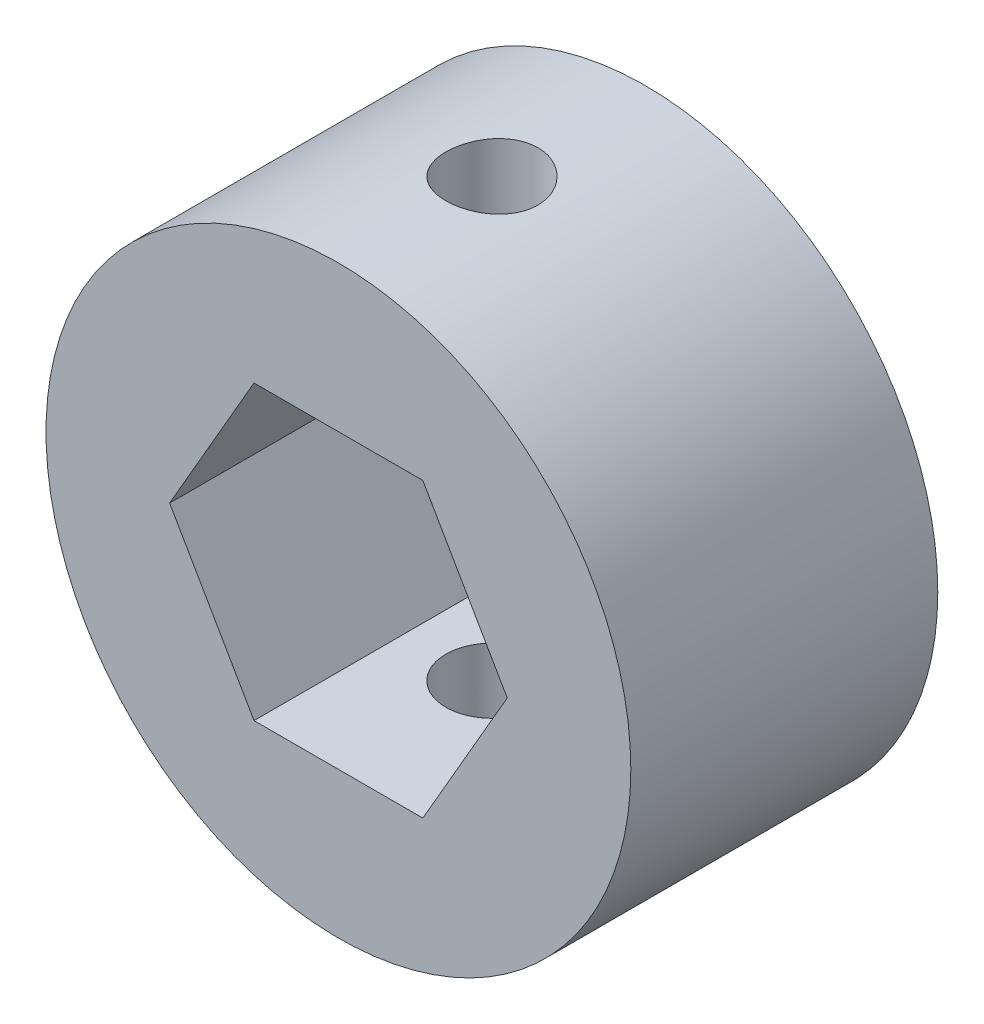
ISO-10303-21;
HEADER;
FILE_DESCRIPTION(('STEP AP214'),'2;1');
FILE_NAME('part.step','',(''),(''),'','','');
FILE_SCHEMA(('AUTOMOTIVE_DESIGN { 1 0 10303 214 1 1 1 1 }'));
ENDSEC;
DATA;
#1=APPLICATION_CONTEXT('core data for automotive mechanical design processes');
#2=APPLICATION_PROTOCOL_DEFINITION('international standard','automotive_design',2000,#1);
#3=PRODUCT_CONTEXT('',#1,'mechanical');
#4=PRODUCT('Part','Part','',(#3));
#5=PRODUCT_RELATED_PRODUCT_CATEGORY('part','',(#4));
#6=PRODUCT_DEFINITION_FORMATION('','',#4);
#7=PRODUCT_DEFINITION_CONTEXT('part definition',#1,'design');
#8=PRODUCT_DEFINITION('design','',#6,#7);
#9=PRODUCT_DEFINITION_SHAPE('','',#8);
#10=(LENGTH_UNIT() NAMED_UNIT(*) SI_UNIT(.MILLI.,.METRE.));
#11=(NAMED_UNIT(*) PLANE_ANGLE_UNIT() SI_UNIT($,.RADIAN.));
#12=(NAMED_UNIT(*) SI_UNIT($,.STERADIAN.) SOLID_ANGLE_UNIT());
#13=UNCERTAINTY_MEASURE_WITH_UNIT(LENGTH_MEASURE(1.E-05),#10,'distance_accuracy_value','');
#14=(GEOMETRIC_REPRESENTATION_CONTEXT(3) GLOBAL_UNCERTAINTY_ASSIGNED_CONTEXT((#13)) GLOBAL_UNIT_ASSIGNED_CONTEXT((#10,
#11,#12)) REPRESENTATION_CONTEXT('',''));
#15=CARTESIAN_POINT('',(0.,0.,0.));
#16=DIRECTION('',(0.,0.,1.));
#17=DIRECTION('',(1.,0.,0.));
#18=AXIS2_PLACEMENT_3D('',#15,#16,#17);
#19=CARTESIAN_POINT('',(0.,0.,10.));
#20=DIRECTION('',(0.,0.,1.));
#21=DIRECTION('',(1.,0.,0.));
#22=AXIS2_PLACEMENT_3D('',#19,#20,#21);
#23=PLANE('',#22);
#24=CARTESIAN_POINT('',(0.,0.,10.));
#25=DIRECTION('',(0.,0.,1.));
#26=DIRECTION('',(1.,0.,0.));
#27=AXIS2_PLACEMENT_3D('',#24,#25,#26);
#28=CIRCLE('',#27,9.525);
#29=CARTESIAN_POINT('',(9.525,0.,10.));
#30=VERTEX_POINT('',#29);
#31=EDGE_CURVE('E11',#30,#30,#28,.T.);
#32=ORIENTED_EDGE('',*,*,#31,.T.);
#33=EDGE_LOOP('',(#32));
#34=FACE_BOUND('',#33,.T.);
#35=DIRECTION('',(-0.5,0.866025403784439,0.));
#36=VECTOR('',#35,1.);
#37=CARTESIAN_POINT('',(5.49926131403119,0.,10.));
#38=LINE('',#37,#36);
#39=CARTESIAN_POINT('',(5.49926131403119,0.,10.));
#40=VERTEX_POINT('',#39);
#41=CARTESIAN_POINT('',(2.74963065701559,4.76250000000001,10.));
#42=VERTEX_POINT('',#41);
#43=EDGE_CURVE('E105',#40,#42,#38,.T.);
#44=ORIENTED_EDGE('',*,*,#43,.F.);
#45=DIRECTION('',(0.5,0.866025403784438,0.));
#46=VECTOR('',#45,1.);
#47=CARTESIAN_POINT('',(2.74963065701559,-4.76250000000001,10.));
#48=LINE('',#47,#46);
#49=CARTESIAN_POINT('',(2.74963065701559,-4.76250000000001,10.));
#50=VERTEX_POINT('',#49);
#51=EDGE_CURVE('E96',#50,#40,#48,.T.);
#52=ORIENTED_EDGE('',*,*,#51,.F.);
#53=DIRECTION('',(1.,0.,0.));
#54=VECTOR('',#53,1.);
#55=CARTESIAN_POINT('',(-2.7496306570156,-4.76250000000001,10.));
#56=LINE('',#55,#54);
#57=CARTESIAN_POINT('',(-2.7496306570156,-4.76250000000001,10.));
#58=VERTEX_POINT('',#57);
#59=EDGE_CURVE('E131',#58,#50,#56,.T.);
#60=ORIENTED_EDGE('',*,*,#59,.F.);
#61=DIRECTION('',(0.5,-0.866025403784439,0.));
#62=VECTOR('',#61,1.);
#63=CARTESIAN_POINT('',(-5.49926131403119,0.,10.));
#64=LINE('',#63,#62);
#65=CARTESIAN_POINT('',(-5.49926131403119,0.,10.));
#66=VERTEX_POINT('',#65);
#67=EDGE_CURVE('E128',#66,#58,#64,.T.);
#68=ORIENTED_EDGE('',*,*,#67,.F.);
#69=DIRECTION('',(-0.5,-0.866025403784439,0.));
#70=VECTOR('',#69,1.);
#71=CARTESIAN_POINT('',(-2.74963065701559,4.76250000000001,10.));
#72=LINE('',#71,#70);
#73=CARTESIAN_POINT('',(-2.74963065701559,4.76250000000001,10.));
#74=VERTEX_POINT('',#73);
#75=EDGE_CURVE('E122',#74,#66,#72,.T.);
#76=ORIENTED_EDGE('',*,*,#75,.F.);
#77=DIRECTION('',(-1.,0.,0.));
#78=VECTOR('',#77,1.);
#79=CARTESIAN_POINT('',(2.74963065701559,4.76250000000001,10.));
#80=LINE('',#79,#78);
#81=EDGE_CURVE('E118',#42,#74,#80,.T.);
#82=ORIENTED_EDGE('',*,*,#81,.F.);
#83=EDGE_LOOP('',(#44,#52,#60,#68,#76,#82));
#84=FACE_BOUND('',#83,.T.);
#85=ADVANCED_FACE('F39',(#34,#84),#23,.T.);
#86=CARTESIAN_POINT('',(0.,0.,0.));
#87=DIRECTION('',(0.,0.,1.));
#88=DIRECTION('',(1.,0.,0.));
#89=AXIS2_PLACEMENT_3D('',#86,#87,#88);
#90=PLANE('',#89);
#91=CARTESIAN_POINT('',(0.,0.,0.));
#92=DIRECTION('',(0.,0.,1.));
#93=DIRECTION('',(1.,0.,0.));
#94=AXIS2_PLACEMENT_3D('',#91,#92,#93);
#95=CIRCLE('',#94,9.525);
#96=CARTESIAN_POINT('',(9.525,0.,0.));
#97=VERTEX_POINT('',#96);
#98=EDGE_CURVE('E50',#97,#97,#95,.T.);
#99=ORIENTED_EDGE('',*,*,#98,.F.);
#100=EDGE_LOOP('',(#99));
#101=FACE_BOUND('',#100,.T.);
#102=DIRECTION('',(0.5,0.866025403784438,0.));
#103=VECTOR('',#102,1.);
#104=CARTESIAN_POINT('',(2.74963065701559,-4.76250000000001,0.));
#105=LINE('',#104,#103);
#106=CARTESIAN_POINT('',(2.74963065701559,-4.76250000000001,0.));
#107=VERTEX_POINT('',#106);
#108=CARTESIAN_POINT('',(5.49926131403119,0.,0.));
#109=VERTEX_POINT('',#108);
#110=EDGE_CURVE('E66',#107,#109,#105,.T.);
#111=ORIENTED_EDGE('',*,*,#110,.T.);
#112=DIRECTION('',(-0.5,0.866025403784439,0.));
#113=VECTOR('',#112,1.);
#114=CARTESIAN_POINT('',(5.49926131403119,0.,0.));
#115=LINE('',#114,#113);
#116=CARTESIAN_POINT('',(2.74963065701559,4.76250000000001,0.));
#117=VERTEX_POINT('',#116);
#118=EDGE_CURVE('E112',#109,#117,#115,.T.);
#119=ORIENTED_EDGE('',*,*,#118,.T.);
#120=DIRECTION('',(-1.,0.,0.));
#121=VECTOR('',#120,1.);
#122=CARTESIAN_POINT('',(2.74963065701559,4.76250000000001,0.));
#123=LINE('',#122,#121);
#124=CARTESIAN_POINT('',(-2.74963065701559,4.76250000000001,0.));
#125=VERTEX_POINT('',#124);
#126=EDGE_CURVE('E139',#117,#125,#123,.T.);
#127=ORIENTED_EDGE('',*,*,#126,.T.);
#128=DIRECTION('',(-0.5,-0.866025403784439,0.));
#129=VECTOR('',#128,1.);
#130=CARTESIAN_POINT('',(-2.74963065701559,4.76250000000001,0.));
#131=LINE('',#130,#129);
#132=CARTESIAN_POINT('',(-5.49926131403119,0.,0.));
#133=VERTEX_POINT('',#132);
#134=EDGE_CURVE('E143',#125,#133,#131,.T.);
#135=ORIENTED_EDGE('',*,*,#134,.T.);
#136=DIRECTION('',(0.5,-0.866025403784439,0.));
#137=VECTOR('',#136,1.);
#138=CARTESIAN_POINT('',(-5.49926131403119,0.,0.));
#139=LINE('',#138,#137);
#140=CARTESIAN_POINT('',(-2.7496306570156,-4.76250000000001,0.));
#141=VERTEX_POINT('',#140);
#142=EDGE_CURVE('E147',#133,#141,#139,.T.);
#143=ORIENTED_EDGE('',*,*,#142,.T.);
#144=DIRECTION('',(1.,0.,0.));
#145=VECTOR('',#144,1.);
#146=CARTESIAN_POINT('',(-2.7496306570156,-4.76250000000001,0.));
#147=LINE('',#146,#145);
#148=EDGE_CURVE('E106',#141,#107,#147,.T.);
#149=ORIENTED_EDGE('',*,*,#148,.T.);
#150=EDGE_LOOP('',(#111,#119,#127,#135,#143,#149));
#151=FACE_BOUND('',#150,.T.);
#152=ADVANCED_FACE('F170',(#101,#151),#90,.F.);
#153=CARTESIAN_POINT('',(0.,0.,10.));
#154=DIRECTION('',(0.,0.,-1.));
#155=DIRECTION('',(-1.,0.,0.));
#156=AXIS2_PLACEMENT_3D('',#153,#154,#155);
#157=CYLINDRICAL_SURFACE('',#156,9.525);
#158=CARTESIAN_POINT('',(0.,-9.525,3.5));
#159=CARTESIAN_POINT('',(-0.0837004981113219,-9.52499861431711,3.5000034117186));
#160=CARTESIAN_POINT('',(-0.167448306518957,-9.52388519686806,3.50702943148774));
#161=CARTESIAN_POINT('',(-0.332599561301522,-9.51955073691311,3.53493876525838));
#162=CARTESIAN_POINT('',(-0.41400070357824,-9.5163276920145,3.55583524493464));
#163=CARTESIAN_POINT('',(-0.572044950152506,-9.5081358738709,3.61084268086304));
#164=CARTESIAN_POINT('',(-0.648691725845267,-9.50316846790323,3.6449432895051));
#165=CARTESIAN_POINT('',(-0.795164565043412,-9.49203563759321,3.72536490137845));
#166=CARTESIAN_POINT('',(-0.864991501003513,-9.48587036679488,3.77168433865497));
#167=CARTESIAN_POINT('',(-0.996452227925343,-9.47296735087495,3.8756517143726));
#168=CARTESIAN_POINT('',(-1.05801905042189,-9.46622557658096,3.9333838395024));
#169=CARTESIAN_POINT('',(-1.17063379829871,-9.45296062384451,4.05835659561294));
#170=CARTESIAN_POINT('',(-1.22168109355484,-9.4464374585164,4.12559779578473));
#171=CARTESIAN_POINT('',(-1.31207183149559,-9.43430924972908,4.26813438198425));
#172=CARTESIAN_POINT('',(-1.35134985011303,-9.42870941361916,4.34347173883964));
#173=CARTESIAN_POINT('',(-1.4166688586755,-9.41911731619023,4.49977745483656));
#174=CARTESIAN_POINT('',(-1.44271064488462,-9.41512495817169,4.58074547491595));
#175=CARTESIAN_POINT('',(-1.48060864099661,-9.40923968756167,4.74530731536871));
#176=CARTESIAN_POINT('',(-1.49257993540557,-9.40732975200256,4.82887401211105));
#177=CARTESIAN_POINT('',(-1.50235377921514,-9.40577398086126,4.99685021465162));
#178=CARTESIAN_POINT('',(-1.50015722436291,-9.4061280021428,5.08125966683063));
#179=CARTESIAN_POINT('',(-1.48175163550809,-9.40904458848467,5.24770861393035));
#180=CARTESIAN_POINT('',(-1.46567125735665,-9.41158687510008,5.32976274209885));
#181=CARTESIAN_POINT('',(-1.42015610396549,-9.41856183519883,5.48999358796895));
#182=CARTESIAN_POINT('',(-1.39072091576478,-9.42299456713877,5.56817018568558));
#183=CARTESIAN_POINT('',(-1.31919936399662,-9.43327314532736,5.71881552121264));
#184=CARTESIAN_POINT('',(-1.27705897322292,-9.43912500501605,5.79125818151329));
#185=CARTESIAN_POINT('',(-1.1813616519058,-9.45157821200739,5.92809286760226));
#186=CARTESIAN_POINT('',(-1.12780389680637,-9.45817961342545,5.99248431140285));
#187=CARTESIAN_POINT('',(-1.01008822398667,-9.47147747596454,6.1121339712358));
#188=CARTESIAN_POINT('',(-0.94581979108395,-9.47817418186328,6.16728348914476));
#189=CARTESIAN_POINT('',(-0.808882505312319,-9.49084054883768,6.26603109204343));
#190=CARTESIAN_POINT('',(-0.736213608530644,-9.49681020611241,6.30962911664469));
#191=CARTESIAN_POINT('',(-0.584440498538957,-9.50735704011325,6.38404360511161));
#192=CARTESIAN_POINT('',(-0.505331841798512,-9.51193324483591,6.41485115239385));
#193=CARTESIAN_POINT('',(-0.342975372732541,-9.51916958373815,6.46271289901484));
#194=CARTESIAN_POINT('',(-0.259727869636484,-9.52182986083491,6.47976812420908));
#195=CARTESIAN_POINT('',(-0.092394386447166,-9.52491554920489,6.49949532538111));
#196=CARTESIAN_POINT('',(-0.00832642500768306,-9.52536416409759,6.5023166435344));
#197=CARTESIAN_POINT('',(0.159081599433798,-9.52403931415892,6.4938931083708));
#198=CARTESIAN_POINT('',(0.242421687248921,-9.52226592537547,6.48264873645116));
#199=CARTESIAN_POINT('',(0.405551988067928,-9.51671068202159,6.4465372098696));
#200=CARTESIAN_POINT('',(0.485358820893357,-9.51293963371883,6.42174332819296));
#201=CARTESIAN_POINT('',(0.639682902881805,-9.50381038098328,6.35931422602285));
#202=CARTESIAN_POINT('',(0.714199881766603,-9.49845209552491,6.32167834995401));
#203=CARTESIAN_POINT('',(0.856482202395855,-9.48668572902274,6.23428687480408));
#204=CARTESIAN_POINT('',(0.924189069074522,-9.48026962983753,6.18443717213067));
#205=CARTESIAN_POINT('',(1.05032944229019,-9.46712535343445,6.07416342301404));
#206=CARTESIAN_POINT('',(1.10876235108301,-9.46039715613669,6.01373869549497));
#207=CARTESIAN_POINT('',(1.21524397085515,-9.44731277923704,5.88336309282088));
#208=CARTESIAN_POINT('',(1.26319222042968,-9.44096059085153,5.81332970539082));
#209=CARTESIAN_POINT('',(1.34664370406738,-9.42941980950488,5.66611493610305));
#210=CARTESIAN_POINT('',(1.38214730069526,-9.42423118264591,5.58893376257303));
#211=CARTESIAN_POINT('',(1.4395483269152,-9.41563436232062,5.42990572140246));
#212=CARTESIAN_POINT('',(1.46149737249161,-9.41221942262095,5.34807786545402));
#213=CARTESIAN_POINT('',(1.49132974884263,-9.40753913078241,5.18183910134084));
#214=CARTESIAN_POINT('',(1.49921415967798,-9.40627361358403,5.09742839202669));
#215=CARTESIAN_POINT('',(1.50066582356633,-9.40604203614239,4.92942213542109));
#216=CARTESIAN_POINT('',(1.49439110532528,-9.40705059505186,4.84582794604362));
#217=CARTESIAN_POINT('',(1.46804261070918,-9.41119816756823,4.68089995663302));
#218=CARTESIAN_POINT('',(1.44796886584048,-9.41433717631083,4.59956615143937));
#219=CARTESIAN_POINT('',(1.39465007585423,-9.4223827495018,4.44151906775925));
#220=CARTESIAN_POINT('',(1.36141719804569,-9.42728768074878,4.36480159615345));
#221=CARTESIAN_POINT('',(1.28273942612949,-9.43831423797333,4.21800549287547));
#222=CARTESIAN_POINT('',(1.23729403391932,-9.44443591357467,4.14792713214535));
#223=CARTESIAN_POINT('',(1.13491151466284,-9.45728731406023,4.01559754431451));
#224=CARTESIAN_POINT('',(1.07785767465218,-9.46402279674515,3.95343716486696));
#225=CARTESIAN_POINT('',(0.95412438876729,-9.477295765864,3.83951754923379));
#226=CARTESIAN_POINT('',(0.887442716450962,-9.48383320607627,3.78776072551756));
#227=CARTESIAN_POINT('',(0.745865300004344,-9.49601940286327,3.69583207180626));
#228=CARTESIAN_POINT('',(0.670921895884346,-9.50166249057989,3.65573289454583));
#229=CARTESIAN_POINT('',(0.515307699315209,-9.51136881427742,3.58875274873878));
#230=CARTESIAN_POINT('',(0.434642836148078,-9.51543365833633,3.56185831839588));
#231=CARTESIAN_POINT('',(0.294697285899146,-9.5206153633723,3.52803781261472));
#232=CARTESIAN_POINT('',(0.23627318710395,-9.52225100840631,3.51754003445136));
#233=CARTESIAN_POINT('',(0.118573966053792,-9.52444380980324,3.50351996986231));
#234=CARTESIAN_POINT('',(0.0592988560747569,-9.52500098170754,3.49999758291749));
#235=CARTESIAN_POINT('',(0.,-9.525,3.5));
#236=B_SPLINE_CURVE_WITH_KNOTS('',3,(#158,#159,#160,#161,#162,#163,#164,#165,#166,#167,#168,
#169,#170,#171,#172,#173,#174,#175,#176,#177,#178,#179,#180,#181,#182,#183,#184,#185,#186,#187,
#188,#189,#190,#191,#192,#193,#194,#195,#196,#197,#198,#199,#200,#201,#202,#203,#204,#205,#206,
#207,#208,#209,#210,#211,#212,#213,#214,#215,#216,#217,#218,#219,#220,#221,#222,#223,#224,#225,
#226,#227,#228,#229,#230,#231,#232,#233,#234,#235),.UNSPECIFIED.,.T.,.F.,(4,2,2,2,2,2,2,2,2,2,2,
2,2,2,2,2,2,2,2,2,2,2,2,2,2,2,2,2,2,2,2,2,2,2,2,2,2,2,4),(0.,0.250884779703371,0.50200803742736,
0.752934895708255,1.00382961102493,1.25664920880541,1.50948394618747,1.76369914536972,
2.0178990496861,2.27000502066489,2.52209505266859,2.77187383684771,3.02166034527951,
3.27252438923043,3.52340655659148,3.77705891841041,4.03071260623701,4.28454282710605,
4.53835411173862,4.78949678743544,5.04063086802688,5.29042011575275,5.54022211696382,
5.79201287313087,6.0438198516481,6.29794303737635,6.55205881881951,6.80520085726934,
7.0583234554314,7.30863496636871,7.5589459057894,7.80902593902253,8.05911617362772,
8.31185752670771,8.5646574202687,8.81900060168475,9.07308394757002,9.25082954253663,
9.42857257607497),.UNSPECIFIED.);
#237=CARTESIAN_POINT('',(0.,-9.525,3.5));
#238=VERTEX_POINT('',#237);
#239=EDGE_CURVE('E136',#238,#238,#236,.T.);
#240=ORIENTED_EDGE('',*,*,#239,.T.);
#241=EDGE_LOOP('',(#240));
#242=FACE_BOUND('',#241,.T.);
#243=CARTESIAN_POINT('',(-1.5,9.40614825526368,5.));
#244=CARTESIAN_POINT('',(-1.49999658214174,9.40614970690585,4.91630675658256));
#245=CARTESIAN_POINT('',(-1.49297173916421,9.407277369315,4.83256618398631));
#246=CARTESIAN_POINT('',(-1.46506750373019,9.41166266176292,4.66742995924262));
#247=CARTESIAN_POINT('',(-1.44417491918445,9.41492231988089,4.58603661696872));
#248=CARTESIAN_POINT('',(-1.38917887416577,9.42319346407068,4.42800887632905));
#249=CARTESIAN_POINT('',(-1.35508594532195,9.42820355328591,4.35137074053033));
#250=CARTESIAN_POINT('',(-1.27468242797614,9.43940939339245,4.20491242349582));
#251=CARTESIAN_POINT('',(-1.22837338709719,9.44560499406755,4.13509138015687));
#252=CARTESIAN_POINT('',(-1.12441659216259,9.45854479797928,4.00362418725063));
#253=CARTESIAN_POINT('',(-1.06668232201355,9.46529294130129,3.94204682855871));
#254=CARTESIAN_POINT('',(-0.941700827142039,9.47854239185583,3.82941169185389));
#255=CARTESIAN_POINT('',(-0.874453062230225,9.48504368504526,3.77835451159589));
#256=CARTESIAN_POINT('',(-0.731910537956267,9.49710835425545,3.68795328633279));
#257=CARTESIAN_POINT('',(-0.656574937261585,9.50266656553777,3.64867289092065));
#258=CARTESIAN_POINT('',(-0.50027303138254,9.51217507934114,3.58334900628105));
#259=CARTESIAN_POINT('',(-0.419307053851634,9.51612547533565,3.55730474752307));
#260=CARTESIAN_POINT('',(-0.254752229480839,9.52194545109787,3.51940180616735));
#261=CARTESIAN_POINT('',(-0.171190565724827,9.52383194586305,3.50742774824779));
#262=CARTESIAN_POINT('',(-0.00322427414474579,9.52536959813743,3.49764663268661));
#263=CARTESIAN_POINT('',(0.0811803019486129,9.52502089199248,3.49983871091964));
#264=CARTESIAN_POINT('',(0.247648585000672,9.52214089260858,3.51823706108051));
#265=CARTESIAN_POINT('',(0.329726394610962,9.51962893414766,3.53431918982558));
#266=CARTESIAN_POINT('',(0.490003693346638,9.51272621659398,3.57984599457376));
#267=CARTESIAN_POINT('',(0.568203074430389,9.50833540519467,3.60929104259692));
#268=CARTESIAN_POINT('',(0.71887661180213,9.49813523061293,3.68083331395088));
#269=CARTESIAN_POINT('',(0.791325775573119,9.4923200807765,3.72298231481649));
#270=CARTESIAN_POINT('',(0.928169847964099,9.4799184482954,3.81869817771671));
#271=CARTESIAN_POINT('',(0.992564172637368,9.47333190979479,3.87226586680456));
#272=CARTESIAN_POINT('',(1.11220318061291,9.4600369127985,3.98998878015976));
#273=CARTESIAN_POINT('',(1.16734115360176,9.45332790656912,4.05425244439706));
#274=CARTESIAN_POINT('',(1.26606770769186,9.44061348529232,4.19117600853565));
#275=CARTESIAN_POINT('',(1.30965620317203,9.43460807546114,4.26383597067642));
#276=CARTESIAN_POINT('',(1.38406375196427,9.42398075874519,4.41560626535387));
#277=CARTESIAN_POINT('',(1.41487101832414,9.41936013000185,4.49472247179967));
#278=CARTESIAN_POINT('',(1.46272990816177,9.41204748922096,4.65709540855364));
#279=CARTESIAN_POINT('',(1.47978260574975,9.40935532658911,4.74035181500963));
#280=CARTESIAN_POINT('',(1.49950024168229,9.40623325561615,4.90769005550905));
#281=CARTESIAN_POINT('',(1.50231681831229,9.40577950572288,4.99175359202371));
#282=CARTESIAN_POINT('',(1.49388537948417,9.40712224832257,5.15915164296801));
#283=CARTESIAN_POINT('',(1.48263784677994,9.40891866357809,5.24248618232177));
#284=CARTESIAN_POINT('',(1.44652637348264,9.41453736959516,5.40558571089483));
#285=CARTESIAN_POINT('',(1.42173869386128,9.41834831027937,5.4853680102507));
#286=CARTESIAN_POINT('',(1.35933017056093,9.42755723919014,5.63964575475203));
#287=CARTESIAN_POINT('',(1.32170863405786,9.43295531309448,5.71414091421373));
#288=CARTESIAN_POINT('',(1.2343388198906,9.44478611496989,5.85640736173274));
#289=CARTESIAN_POINT('',(1.18449281212141,9.45122703157291,5.9241179380589));
#290=CARTESIAN_POINT('',(1.07422410669186,9.46439344155578,6.05026750576143));
#291=CARTESIAN_POINT('',(1.01380074765622,9.47111895271066,6.10870591693669));
#292=CARTESIAN_POINT('',(0.883422966684557,9.48417166458916,6.21520087133525));
#293=CARTESIAN_POINT('',(0.813385744132123,9.49049461739763,6.2631566433174));
#294=CARTESIAN_POINT('',(0.666161159801011,9.50196285818299,6.34662130875128));
#295=CARTESIAN_POINT('',(0.588974009684583,9.5071081810061,6.3821305705134));
#296=CARTESIAN_POINT('',(0.429948577807125,9.5156228770416,6.4395350510309));
#297=CARTESIAN_POINT('',(0.348130204790518,9.518999294515,6.46148433291005));
#298=CARTESIAN_POINT('',(0.181911557289638,9.5236254124832,6.49132038982719));
#299=CARTESIAN_POINT('',(0.0975114720131384,9.52487526845048,6.49920819289911));
#300=CARTESIAN_POINT('',(-0.0704995100801296,9.52510560176567,6.50067033346535));
#301=CARTESIAN_POINT('',(-0.15410907529349,9.52411046518576,6.49439847868405));
#302=CARTESIAN_POINT('',(-0.319068562512905,9.52001206443881,6.46805032645707));
#303=CARTESIAN_POINT('',(-0.400418494001278,9.51690880911968,6.44797408694917));
#304=CARTESIAN_POINT('',(-0.558500021610939,9.50894137622996,6.39464359480201));
#305=CARTESIAN_POINT('',(-0.635235653930645,9.50407876451503,6.36140105789741));
#306=CARTESIAN_POINT('',(-0.782064089703815,9.49312527818045,6.2826983042231));
#307=CARTESIAN_POINT('',(-0.852156633483515,9.48703435557607,6.23723761012023));
#308=CARTESIAN_POINT('',(-0.984487083609661,9.47422194411823,6.13483755511828));
#309=CARTESIAN_POINT('',(-1.04663685897631,9.4674946179166,6.0777850226485));
#310=CARTESIAN_POINT('',(-1.16053568704725,9.45420956951179,5.95405880800523));
#311=CARTESIAN_POINT('',(-1.21228229867364,9.447651887429,5.8873828740138));
#312=CARTESIAN_POINT('',(-1.3041991141202,9.43540457773849,5.7458108064565));
#313=CARTESIAN_POINT('',(-1.34429504147853,9.42972062405762,5.67086596006251));
#314=CARTESIAN_POINT('',(-1.41126872000466,9.41993105421533,5.51524886537494));
#315=CARTESIAN_POINT('',(-1.43815996589138,9.41582382763532,5.4345825611307));
#316=CARTESIAN_POINT('',(-1.47197212374929,9.41058515295195,5.29464538219116));
#317=CARTESIAN_POINT('',(-1.48246615820553,9.40893032393282,5.23623166991918));
#318=CARTESIAN_POINT('',(-1.49648125428711,9.4067113691513,5.1185532136474));
#319=CARTESIAN_POINT('',(-1.50000242121851,9.40614722691708,5.05928848251352));
#320=CARTESIAN_POINT('',(-1.5,9.40614825526368,5.));
#321=B_SPLINE_CURVE_WITH_KNOTS('',3,(#243,#244,#245,#246,#247,#248,#249,#250,#251,#252,#253,
#254,#255,#256,#257,#258,#259,#260,#261,#262,#263,#264,#265,#266,#267,#268,#269,#270,#271,#272,
#273,#274,#275,#276,#277,#278,#279,#280,#281,#282,#283,#284,#285,#286,#287,#288,#289,#290,#291,
#292,#293,#294,#295,#296,#297,#298,#299,#300,#301,#302,#303,#304,#305,#306,#307,#308,#309,#310,
#311,#312,#313,#314,#315,#316,#317,#318,#319,#320),.UNSPECIFIED.,.T.,.F.,(4,2,2,2,2,2,2,2,2,2,2,
2,2,2,2,2,2,2,2,2,2,2,2,2,2,2,2,2,2,2,2,2,2,2,2,2,2,2,4),(0.,0.250862980910028,
0.501964945134382,0.75286698415195,1.00373725238632,1.2565853849104,1.50944788026641,
1.76365334847252,2.01784403583641,2.26993548879797,2.52201156448535,2.7718577376913,
3.02171086697357,3.27259641906959,3.52350014893296,3.77712275938608,4.03074724999613,
4.28460511800992,4.53844316004851,4.78957162205852,5.0406914642608,5.29041131485254,
5.54014464847694,5.79194360241829,6.04375830634492,6.29789655823792,6.5520272891745,
6.80513815885788,7.05823052286077,7.3085869423139,7.55894231101359,7.80907540529776,
8.05921827308343,8.31193201858461,8.56470499373735,8.81905578490804,9.07314609472655,
9.25086068045604,9.42857258227334),.UNSPECIFIED.);
#322=CARTESIAN_POINT('',(-1.5,9.40614825526368,5.));
#323=VERTEX_POINT('',#322);
#324=EDGE_CURVE('E215',#323,#323,#321,.T.);
#325=ORIENTED_EDGE('',*,*,#324,.T.);
#326=EDGE_LOOP('',(#325));
#327=FACE_BOUND('',#326,.T.);
#328=ORIENTED_EDGE('',*,*,#31,.F.);
#329=EDGE_LOOP('',(#328));
#330=FACE_BOUND('',#329,.T.);
#331=ORIENTED_EDGE('',*,*,#98,.T.);
#332=EDGE_LOOP('',(#331));
#333=FACE_BOUND('',#332,.T.);
#334=ADVANCED_FACE('F41',(#242,#327,#330,#333),#157,.T.);
#335=CARTESIAN_POINT('',(2.74963065701559,-4.76250000000001,10.));
#336=DIRECTION('',(-0.866025403784439,0.5,0.));
#337=DIRECTION('',(-0.5,-0.866025403784439,0.));
#338=AXIS2_PLACEMENT_3D('',#335,#336,#337);
#339=PLANE('',#338);
#340=ORIENTED_EDGE('',*,*,#110,.F.);
#341=DIRECTION('',(0.,0.,-1.));
#342=VECTOR('',#341,1.);
#343=CARTESIAN_POINT('',(2.74963065701559,-4.76250000000001,10.));
#344=LINE('',#343,#342);
#345=EDGE_CURVE('E100',#50,#107,#344,.T.);
#346=ORIENTED_EDGE('',*,*,#345,.F.);
#347=ORIENTED_EDGE('',*,*,#51,.T.);
#348=DIRECTION('',(0.,0.,-1.));
#349=VECTOR('',#348,1.);
#350=CARTESIAN_POINT('',(5.49926131403119,0.,10.));
#351=LINE('',#350,#349);
#352=EDGE_CURVE('E99',#40,#109,#351,.T.);
#353=ORIENTED_EDGE('',*,*,#352,.T.);
#354=EDGE_LOOP('',(#340,#346,#347,#353));
#355=FACE_BOUND('',#354,.T.);
#356=ADVANCED_FACE('F98',(#355),#339,.T.);
#357=CARTESIAN_POINT('',(5.49926131403119,0.,10.));
#358=DIRECTION('',(-0.866025403784439,-0.5,0.));
#359=DIRECTION('',(0.5,-0.866025403784439,0.));
#360=AXIS2_PLACEMENT_3D('',#357,#358,#359);
#361=PLANE('',#360);
#362=ORIENTED_EDGE('',*,*,#118,.F.);
#363=ORIENTED_EDGE('',*,*,#352,.F.);
#364=ORIENTED_EDGE('',*,*,#43,.T.);
#365=DIRECTION('',(0.,0.,-1.));
#366=VECTOR('',#365,1.);
#367=CARTESIAN_POINT('',(2.74963065701559,4.76250000000001,10.));
#368=LINE('',#367,#366);
#369=EDGE_CURVE('E114',#42,#117,#368,.T.);
#370=ORIENTED_EDGE('',*,*,#369,.T.);
#371=EDGE_LOOP('',(#362,#363,#364,#370));
#372=FACE_BOUND('',#371,.T.);
#373=ADVANCED_FACE('F109',(#372),#361,.T.);
#374=CARTESIAN_POINT('',(2.74963065701559,4.76250000000001,10.));
#375=DIRECTION('',(0.,-1.,0.));
#376=DIRECTION('',(1.,0.,0.));
#377=AXIS2_PLACEMENT_3D('',#374,#375,#376);
#378=PLANE('',#377);
#379=CARTESIAN_POINT('',(0.,4.76250000000001,5.));
#380=DIRECTION('',(0.,-1.,0.));
#381=DIRECTION('',(1.,0.,0.));
#382=AXIS2_PLACEMENT_3D('',#379,#380,#381);
#383=CIRCLE('',#382,1.5);
#384=CARTESIAN_POINT('',(1.5,4.76250000000001,5.));
#385=VERTEX_POINT('',#384);
#386=EDGE_CURVE('E219',#385,#385,#383,.T.);
#387=ORIENTED_EDGE('',*,*,#386,.F.);
#388=EDGE_LOOP('',(#387));
#389=FACE_BOUND('',#388,.T.);
#390=ORIENTED_EDGE('',*,*,#126,.F.);
#391=ORIENTED_EDGE('',*,*,#369,.F.);
#392=ORIENTED_EDGE('',*,*,#81,.T.);
#393=DIRECTION('',(0.,0.,-1.));
#394=VECTOR('',#393,1.);
#395=CARTESIAN_POINT('',(-2.74963065701559,4.76250000000001,10.));
#396=LINE('',#395,#394);
#397=EDGE_CURVE('E161',#74,#125,#396,.T.);
#398=ORIENTED_EDGE('',*,*,#397,.T.);
#399=EDGE_LOOP('',(#390,#391,#392,#398));
#400=FACE_BOUND('',#399,.T.);
#401=ADVANCED_FACE('F185',(#389,#400),#378,.T.);
#402=CARTESIAN_POINT('',(-2.74963065701559,4.76250000000001,10.));
#403=DIRECTION('',(0.866025403784439,-0.5,0.));
#404=DIRECTION('',(0.5,0.866025403784439,0.));
#405=AXIS2_PLACEMENT_3D('',#402,#403,#404);
#406=PLANE('',#405);
#407=ORIENTED_EDGE('',*,*,#134,.F.);
#408=ORIENTED_EDGE('',*,*,#397,.F.);
#409=ORIENTED_EDGE('',*,*,#75,.T.);
#410=DIRECTION('',(0.,0.,-1.));
#411=VECTOR('',#410,1.);
#412=CARTESIAN_POINT('',(-5.49926131403119,0.,10.));
#413=LINE('',#412,#411);
#414=EDGE_CURVE('E158',#66,#133,#413,.T.);
#415=ORIENTED_EDGE('',*,*,#414,.T.);
#416=EDGE_LOOP('',(#407,#408,#409,#415));
#417=FACE_BOUND('',#416,.T.);
#418=ADVANCED_FACE('F181',(#417),#406,.T.);
#419=CARTESIAN_POINT('',(-5.49926131403119,0.,10.));
#420=DIRECTION('',(0.866025403784439,0.5,0.));
#421=DIRECTION('',(-0.5,0.866025403784439,0.));
#422=AXIS2_PLACEMENT_3D('',#419,#420,#421);
#423=PLANE('',#422);
#424=ORIENTED_EDGE('',*,*,#142,.F.);
#425=ORIENTED_EDGE('',*,*,#414,.F.);
#426=ORIENTED_EDGE('',*,*,#67,.T.);
#427=DIRECTION('',(0.,0.,-1.));
#428=VECTOR('',#427,1.);
#429=CARTESIAN_POINT('',(-2.7496306570156,-4.76250000000001,10.));
#430=LINE('',#429,#428);
#431=EDGE_CURVE('E58',#58,#141,#430,.T.);
#432=ORIENTED_EDGE('',*,*,#431,.T.);
#433=EDGE_LOOP('',(#424,#425,#426,#432));
#434=FACE_BOUND('',#433,.T.);
#435=ADVANCED_FACE('F178',(#434),#423,.T.);
#436=CARTESIAN_POINT('',(-2.7496306570156,-4.76250000000001,10.));
#437=DIRECTION('',(0.,1.,0.));
#438=DIRECTION('',(-1.,0.,0.));
#439=AXIS2_PLACEMENT_3D('',#436,#437,#438);
#440=PLANE('',#439);
#441=CARTESIAN_POINT('',(0.,-4.76250000000001,5.));
#442=DIRECTION('',(0.,1.,0.));
#443=DIRECTION('',(-1.,0.,0.));
#444=AXIS2_PLACEMENT_3D('',#441,#442,#443);
#445=CIRCLE('',#444,1.5);
#446=CARTESIAN_POINT('',(-1.5,-4.76250000000001,5.));
#447=VERTEX_POINT('',#446);
#448=EDGE_CURVE('E44',#447,#447,#445,.T.);
#449=ORIENTED_EDGE('',*,*,#448,.F.);
#450=EDGE_LOOP('',(#449));
#451=FACE_BOUND('',#450,.T.);
#452=ORIENTED_EDGE('',*,*,#148,.F.);
#453=ORIENTED_EDGE('',*,*,#431,.F.);
#454=ORIENTED_EDGE('',*,*,#59,.T.);
#455=ORIENTED_EDGE('',*,*,#345,.T.);
#456=EDGE_LOOP('',(#452,#453,#454,#455));
#457=FACE_BOUND('',#456,.T.);
#458=ADVANCED_FACE('F174',(#451,#457),#440,.T.);
#459=CARTESIAN_POINT('',(0.,-9.525,5.));
#460=DIRECTION('',(0.,1.,0.));
#461=DIRECTION('',(-1.,0.,0.));
#462=AXIS2_PLACEMENT_3D('',#459,#460,#461);
#463=CYLINDRICAL_SURFACE('',#462,1.5);
#464=ORIENTED_EDGE('',*,*,#448,.T.);
#465=EDGE_LOOP('',(#464));
#466=FACE_BOUND('',#465,.T.);
#467=ORIENTED_EDGE('',*,*,#239,.F.);
#468=EDGE_LOOP('',(#467));
#469=FACE_BOUND('',#468,.T.);
#470=ADVANCED_FACE('F232',(#466,#469),#463,.F.);
#471=ORIENTED_EDGE('',*,*,#386,.T.);
#472=EDGE_LOOP('',(#471));
#473=FACE_BOUND('',#472,.T.);
#474=ORIENTED_EDGE('',*,*,#324,.F.);
#475=EDGE_LOOP('',(#474));
#476=FACE_BOUND('',#475,.T.);
#477=ADVANCED_FACE('F236',(#473,#476),#463,.F.);
#478=CLOSED_SHELL('',(#85,#152,#334,#356,#373,#401,#418,#435,#458,#470,#477));
#479=MANIFOLD_SOLID_BREP('B2',#478);
#480=ADVANCED_BREP_SHAPE_REPRESENTATION('',(#18,#479),#14);
#481=SHAPE_DEFINITION_REPRESENTATION(#9,#480);
ENDSEC;
END-ISO-10303-21;
